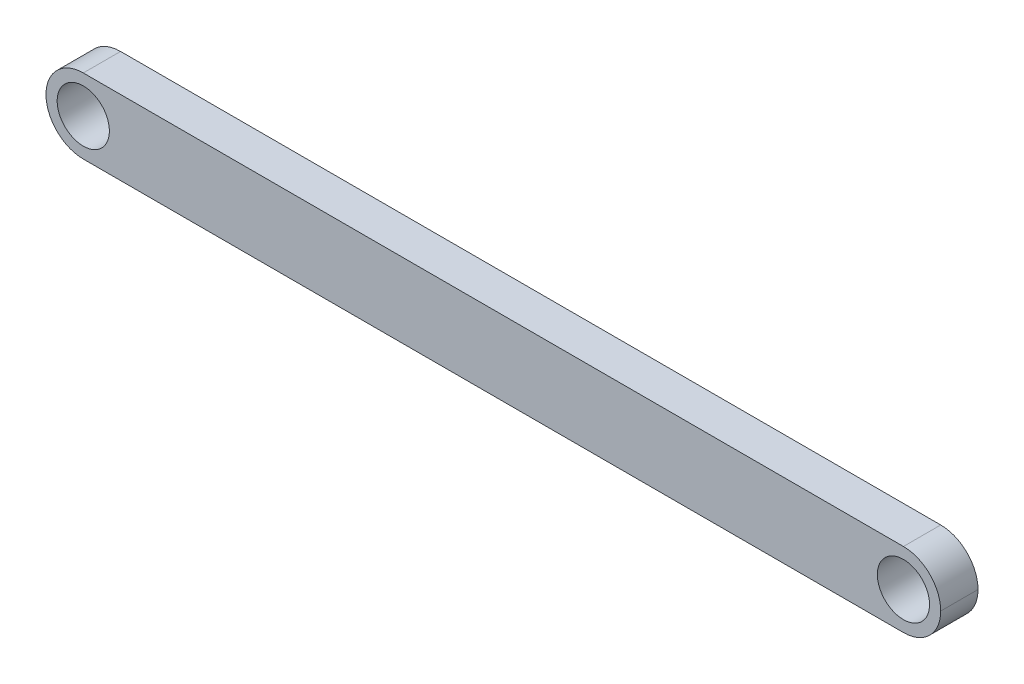
ISO-10303-21;
HEADER;
FILE_DESCRIPTION(('STEP AP214'),'2;1');
FILE_NAME('part.step','',(''),(''),'','','');
FILE_SCHEMA(('AUTOMOTIVE_DESIGN { 1 0 10303 214 1 1 1 1 }'));
ENDSEC;
DATA;
#1=APPLICATION_CONTEXT('core data for automotive mechanical design processes');
#2=APPLICATION_PROTOCOL_DEFINITION('international standard','automotive_design',2000,#1);
#3=PRODUCT_CONTEXT('',#1,'mechanical');
#4=PRODUCT('Part','Part','',(#3));
#5=PRODUCT_RELATED_PRODUCT_CATEGORY('part','',(#4));
#6=PRODUCT_DEFINITION_FORMATION('','',#4);
#7=PRODUCT_DEFINITION_CONTEXT('part definition',#1,'design');
#8=PRODUCT_DEFINITION('design','',#6,#7);
#9=PRODUCT_DEFINITION_SHAPE('','',#8);
#10=(LENGTH_UNIT() NAMED_UNIT(*) SI_UNIT(.MILLI.,.METRE.));
#11=(NAMED_UNIT(*) PLANE_ANGLE_UNIT() SI_UNIT($,.RADIAN.));
#12=(NAMED_UNIT(*) SI_UNIT($,.STERADIAN.) SOLID_ANGLE_UNIT());
#13=UNCERTAINTY_MEASURE_WITH_UNIT(LENGTH_MEASURE(1.E-05),#10,'distance_accuracy_value','');
#14=(GEOMETRIC_REPRESENTATION_CONTEXT(3) GLOBAL_UNCERTAINTY_ASSIGNED_CONTEXT((#13)) GLOBAL_UNIT_ASSIGNED_CONTEXT((#10,
#11,#12)) REPRESENTATION_CONTEXT('',''));
#15=CARTESIAN_POINT('',(0.,0.,0.));
#16=DIRECTION('',(0.,0.,1.));
#17=DIRECTION('',(1.,0.,0.));
#18=AXIS2_PLACEMENT_3D('',#15,#16,#17);
#19=CARTESIAN_POINT('',(0.,0.,10.));
#20=DIRECTION('',(0.,0.,-1.));
#21=DIRECTION('',(-1.,0.,0.));
#22=AXIS2_PLACEMENT_3D('',#19,#20,#21);
#23=PLANE('',#22);
#24=CARTESIAN_POINT('',(110.,0.,10.));
#25=DIRECTION('',(0.,0.,-1.));
#26=DIRECTION('',(-1.,0.,0.));
#27=AXIS2_PLACEMENT_3D('',#24,#25,#26);
#28=CIRCLE('',#27,10.);
#29=CARTESIAN_POINT('',(110.,-10.,10.));
#30=VERTEX_POINT('',#29);
#31=CARTESIAN_POINT('',(120.,0.,10.));
#32=VERTEX_POINT('',#31);
#33=EDGE_CURVE('E136',#30,#32,#28,.F.);
#34=ORIENTED_EDGE('',*,*,#33,.T.);
#35=CARTESIAN_POINT('',(110.,0.,10.));
#36=DIRECTION('',(0.,0.,-1.));
#37=DIRECTION('',(-1.,0.,0.));
#38=AXIS2_PLACEMENT_3D('',#35,#36,#37);
#39=CIRCLE('',#38,10.);
#40=CARTESIAN_POINT('',(110.,10.,10.));
#41=VERTEX_POINT('',#40);
#42=EDGE_CURVE('E138',#32,#41,#39,.F.);
#43=ORIENTED_EDGE('',*,*,#42,.T.);
#44=DIRECTION('',(-1.,0.,0.));
#45=VECTOR('',#44,1.);
#46=CARTESIAN_POINT('',(-120.,10.,10.));
#47=LINE('',#46,#45);
#48=CARTESIAN_POINT('',(-110.,10.,10.));
#49=VERTEX_POINT('',#48);
#50=EDGE_CURVE('E111',#41,#49,#47,.T.);
#51=ORIENTED_EDGE('',*,*,#50,.T.);
#52=CARTESIAN_POINT('',(-110.,0.,10.));
#53=DIRECTION('',(0.,0.,-1.));
#54=DIRECTION('',(-1.,0.,0.));
#55=AXIS2_PLACEMENT_3D('',#52,#53,#54);
#56=CIRCLE('',#55,10.);
#57=CARTESIAN_POINT('',(-120.,0.,10.));
#58=VERTEX_POINT('',#57);
#59=EDGE_CURVE('E101',#49,#58,#56,.F.);
#60=ORIENTED_EDGE('',*,*,#59,.T.);
#61=CARTESIAN_POINT('',(-110.,0.,10.));
#62=DIRECTION('',(0.,0.,-1.));
#63=DIRECTION('',(-1.,0.,0.));
#64=AXIS2_PLACEMENT_3D('',#61,#62,#63);
#65=CIRCLE('',#64,10.);
#66=CARTESIAN_POINT('',(-110.,-10.,10.));
#67=VERTEX_POINT('',#66);
#68=EDGE_CURVE('E59',#58,#67,#65,.F.);
#69=ORIENTED_EDGE('',*,*,#68,.T.);
#70=DIRECTION('',(1.,0.,0.));
#71=VECTOR('',#70,1.);
#72=CARTESIAN_POINT('',(-120.,-10.,10.));
#73=LINE('',#72,#71);
#74=EDGE_CURVE('E126',#67,#30,#73,.T.);
#75=ORIENTED_EDGE('',*,*,#74,.T.);
#76=EDGE_LOOP('',(#34,#43,#51,#60,#69,#75));
#77=FACE_BOUND('',#76,.T.);
#78=CARTESIAN_POINT('',(-110.,0.,10.));
#79=DIRECTION('',(0.,0.,1.));
#80=DIRECTION('',(1.,0.,0.));
#81=AXIS2_PLACEMENT_3D('',#78,#79,#80);
#82=CIRCLE('',#81,7.00000000000002);
#83=CARTESIAN_POINT('',(-103.,0.,10.));
#84=VERTEX_POINT('',#83);
#85=EDGE_CURVE('E119',#84,#84,#82,.T.);
#86=ORIENTED_EDGE('',*,*,#85,.F.);
#87=EDGE_LOOP('',(#86));
#88=FACE_BOUND('',#87,.T.);
#89=CARTESIAN_POINT('',(110.,0.,10.));
#90=DIRECTION('',(0.,0.,1.));
#91=DIRECTION('',(1.,0.,0.));
#92=AXIS2_PLACEMENT_3D('',#89,#90,#91);
#93=CIRCLE('',#92,7.00000000000002);
#94=CARTESIAN_POINT('',(117.,0.,10.));
#95=VERTEX_POINT('',#94);
#96=EDGE_CURVE('E143',#95,#95,#93,.T.);
#97=ORIENTED_EDGE('',*,*,#96,.F.);
#98=EDGE_LOOP('',(#97));
#99=FACE_BOUND('',#98,.T.);
#100=ADVANCED_FACE('F37',(#77,#88,#99),#23,.F.);
#101=CARTESIAN_POINT('',(0.,0.,0.));
#102=DIRECTION('',(0.,0.,-1.));
#103=DIRECTION('',(-1.,0.,0.));
#104=AXIS2_PLACEMENT_3D('',#101,#102,#103);
#105=PLANE('',#104);
#106=CARTESIAN_POINT('',(-110.,0.,0.));
#107=DIRECTION('',(0.,0.,1.));
#108=DIRECTION('',(1.,0.,0.));
#109=AXIS2_PLACEMENT_3D('',#106,#107,#108);
#110=CIRCLE('',#109,7.00000000000002);
#111=CARTESIAN_POINT('',(-103.,0.,0.));
#112=VERTEX_POINT('',#111);
#113=EDGE_CURVE('E123',#112,#112,#110,.T.);
#114=ORIENTED_EDGE('',*,*,#113,.T.);
#115=EDGE_LOOP('',(#114));
#116=FACE_BOUND('',#115,.T.);
#117=DIRECTION('',(-1.,0.,0.));
#118=VECTOR('',#117,1.);
#119=CARTESIAN_POINT('',(-120.,10.,0.));
#120=LINE('',#119,#118);
#121=CARTESIAN_POINT('',(110.,10.,0.));
#122=VERTEX_POINT('',#121);
#123=CARTESIAN_POINT('',(-110.,10.,0.));
#124=VERTEX_POINT('',#123);
#125=EDGE_CURVE('E108',#122,#124,#120,.T.);
#126=ORIENTED_EDGE('',*,*,#125,.F.);
#127=CARTESIAN_POINT('',(110.,0.,0.));
#128=DIRECTION('',(0.,0.,-1.));
#129=DIRECTION('',(-1.,0.,0.));
#130=AXIS2_PLACEMENT_3D('',#127,#128,#129);
#131=CIRCLE('',#130,10.);
#132=CARTESIAN_POINT('',(120.,0.,0.));
#133=VERTEX_POINT('',#132);
#134=EDGE_CURVE('E91',#122,#133,#131,.T.);
#135=ORIENTED_EDGE('',*,*,#134,.T.);
#136=CARTESIAN_POINT('',(110.,0.,0.));
#137=DIRECTION('',(0.,0.,-1.));
#138=DIRECTION('',(-1.,0.,0.));
#139=AXIS2_PLACEMENT_3D('',#136,#137,#138);
#140=CIRCLE('',#139,10.);
#141=CARTESIAN_POINT('',(110.,-10.,0.));
#142=VERTEX_POINT('',#141);
#143=EDGE_CURVE('E102',#133,#142,#140,.T.);
#144=ORIENTED_EDGE('',*,*,#143,.T.);
#145=DIRECTION('',(1.,0.,0.));
#146=VECTOR('',#145,1.);
#147=CARTESIAN_POINT('',(-120.,-10.,0.));
#148=LINE('',#147,#146);
#149=CARTESIAN_POINT('',(-110.,-10.,0.));
#150=VERTEX_POINT('',#149);
#151=EDGE_CURVE('E118',#150,#142,#148,.T.);
#152=ORIENTED_EDGE('',*,*,#151,.F.);
#153=CARTESIAN_POINT('',(-110.,0.,0.));
#154=DIRECTION('',(0.,0.,-1.));
#155=DIRECTION('',(-1.,0.,0.));
#156=AXIS2_PLACEMENT_3D('',#153,#154,#155);
#157=CIRCLE('',#156,10.);
#158=CARTESIAN_POINT('',(-120.,0.,0.));
#159=VERTEX_POINT('',#158);
#160=EDGE_CURVE('E131',#150,#159,#157,.T.);
#161=ORIENTED_EDGE('',*,*,#160,.T.);
#162=CARTESIAN_POINT('',(-110.,0.,0.));
#163=DIRECTION('',(0.,0.,-1.));
#164=DIRECTION('',(-1.,0.,0.));
#165=AXIS2_PLACEMENT_3D('',#162,#163,#164);
#166=CIRCLE('',#165,10.);
#167=EDGE_CURVE('E112',#159,#124,#166,.T.);
#168=ORIENTED_EDGE('',*,*,#167,.T.);
#169=EDGE_LOOP('',(#126,#135,#144,#152,#161,#168));
#170=FACE_BOUND('',#169,.T.);
#171=CARTESIAN_POINT('',(110.,0.,0.));
#172=DIRECTION('',(0.,0.,1.));
#173=DIRECTION('',(1.,0.,0.));
#174=AXIS2_PLACEMENT_3D('',#171,#172,#173);
#175=CIRCLE('',#174,7.00000000000002);
#176=CARTESIAN_POINT('',(117.,0.,0.));
#177=VERTEX_POINT('',#176);
#178=EDGE_CURVE('E141',#177,#177,#175,.T.);
#179=ORIENTED_EDGE('',*,*,#178,.T.);
#180=EDGE_LOOP('',(#179));
#181=FACE_BOUND('',#180,.T.);
#182=ADVANCED_FACE('F115',(#116,#170,#181),#105,.T.);
#183=CARTESIAN_POINT('',(-120.,10.,10.));
#184=DIRECTION('',(0.,-1.,0.));
#185=DIRECTION('',(0.,0.,-1.));
#186=AXIS2_PLACEMENT_3D('',#183,#184,#185);
#187=PLANE('',#186);
#188=ORIENTED_EDGE('',*,*,#50,.F.);
#189=DIRECTION('',(0.,0.,-1.));
#190=VECTOR('',#189,1.);
#191=CARTESIAN_POINT('',(110.,10.,10.));
#192=LINE('',#191,#190);
#193=EDGE_CURVE('E95',#41,#122,#192,.T.);
#194=ORIENTED_EDGE('',*,*,#193,.T.);
#195=ORIENTED_EDGE('',*,*,#125,.T.);
#196=DIRECTION('',(0.,0.,-1.));
#197=VECTOR('',#196,1.);
#198=CARTESIAN_POINT('',(-110.,10.,10.));
#199=LINE('',#198,#197);
#200=EDGE_CURVE('E113',#124,#49,#199,.F.);
#201=ORIENTED_EDGE('',*,*,#200,.T.);
#202=EDGE_LOOP('',(#188,#194,#195,#201));
#203=FACE_BOUND('',#202,.T.);
#204=ADVANCED_FACE('F107',(#203),#187,.F.);
#205=CARTESIAN_POINT('',(-120.,-10.,10.));
#206=DIRECTION('',(0.,1.,0.));
#207=DIRECTION('',(0.,0.,1.));
#208=AXIS2_PLACEMENT_3D('',#205,#206,#207);
#209=PLANE('',#208);
#210=ORIENTED_EDGE('',*,*,#151,.T.);
#211=DIRECTION('',(0.,0.,-1.));
#212=VECTOR('',#211,1.);
#213=CARTESIAN_POINT('',(110.,-10.,10.));
#214=LINE('',#213,#212);
#215=EDGE_CURVE('E11',#142,#30,#214,.F.);
#216=ORIENTED_EDGE('',*,*,#215,.T.);
#217=ORIENTED_EDGE('',*,*,#74,.F.);
#218=DIRECTION('',(0.,0.,-1.));
#219=VECTOR('',#218,1.);
#220=CARTESIAN_POINT('',(-110.,-10.,10.));
#221=LINE('',#220,#219);
#222=EDGE_CURVE('E46',#67,#150,#221,.T.);
#223=ORIENTED_EDGE('',*,*,#222,.T.);
#224=EDGE_LOOP('',(#210,#216,#217,#223));
#225=FACE_BOUND('',#224,.T.);
#226=ADVANCED_FACE('F173',(#225),#209,.F.);
#227=CARTESIAN_POINT('',(-110.,0.,10.));
#228=DIRECTION('',(0.,0.,-1.));
#229=DIRECTION('',(-1.,0.,0.));
#230=AXIS2_PLACEMENT_3D('',#227,#228,#229);
#231=CYLINDRICAL_SURFACE('',#230,7.00000000000002);
#232=ORIENTED_EDGE('',*,*,#85,.T.);
#233=EDGE_LOOP('',(#232));
#234=FACE_BOUND('',#233,.T.);
#235=ORIENTED_EDGE('',*,*,#113,.F.);
#236=EDGE_LOOP('',(#235));
#237=FACE_BOUND('',#236,.T.);
#238=ADVANCED_FACE('F170',(#234,#237),#231,.F.);
#239=CARTESIAN_POINT('',(110.,0.,10.));
#240=DIRECTION('',(0.,0.,-1.));
#241=DIRECTION('',(-1.,0.,0.));
#242=AXIS2_PLACEMENT_3D('',#239,#240,#241);
#243=CYLINDRICAL_SURFACE('',#242,7.00000000000002);
#244=ORIENTED_EDGE('',*,*,#96,.T.);
#245=EDGE_LOOP('',(#244));
#246=FACE_BOUND('',#245,.T.);
#247=ORIENTED_EDGE('',*,*,#178,.F.);
#248=EDGE_LOOP('',(#247));
#249=FACE_BOUND('',#248,.T.);
#250=ADVANCED_FACE('F159',(#246,#249),#243,.F.);
#251=CARTESIAN_POINT('',(110.,0.,10.));
#252=DIRECTION('',(0.,0.,-1.));
#253=DIRECTION('',(-1.,0.,0.));
#254=AXIS2_PLACEMENT_3D('',#251,#252,#253);
#255=CYLINDRICAL_SURFACE('',#254,10.);
#256=DIRECTION('',(0.,0.,-1.));
#257=VECTOR('',#256,1.);
#258=CARTESIAN_POINT('',(120.,0.,10.));
#259=LINE('',#258,#257);
#260=EDGE_CURVE('E97',#32,#133,#259,.T.);
#261=ORIENTED_EDGE('',*,*,#260,.F.);
#262=ORIENTED_EDGE('',*,*,#33,.F.);
#263=ORIENTED_EDGE('',*,*,#215,.F.);
#264=ORIENTED_EDGE('',*,*,#143,.F.);
#265=EDGE_LOOP('',(#261,#262,#263,#264));
#266=FACE_BOUND('',#265,.T.);
#267=ADVANCED_FACE('F180',(#266),#255,.T.);
#268=CARTESIAN_POINT('',(110.,0.,10.));
#269=DIRECTION('',(0.,0.,-1.));
#270=DIRECTION('',(-1.,0.,0.));
#271=AXIS2_PLACEMENT_3D('',#268,#269,#270);
#272=CYLINDRICAL_SURFACE('',#271,10.);
#273=ORIENTED_EDGE('',*,*,#42,.F.);
#274=ORIENTED_EDGE('',*,*,#260,.T.);
#275=ORIENTED_EDGE('',*,*,#134,.F.);
#276=ORIENTED_EDGE('',*,*,#193,.F.);
#277=EDGE_LOOP('',(#273,#274,#275,#276));
#278=FACE_BOUND('',#277,.T.);
#279=ADVANCED_FACE('F94',(#278),#272,.T.);
#280=CARTESIAN_POINT('',(-110.,0.,10.));
#281=DIRECTION('',(0.,0.,-1.));
#282=DIRECTION('',(-1.,0.,0.));
#283=AXIS2_PLACEMENT_3D('',#280,#281,#282);
#284=CYLINDRICAL_SURFACE('',#283,10.);
#285=DIRECTION('',(0.,0.,-1.));
#286=VECTOR('',#285,1.);
#287=CARTESIAN_POINT('',(-120.,0.,10.));
#288=LINE('',#287,#286);
#289=EDGE_CURVE('E41',#58,#159,#288,.T.);
#290=ORIENTED_EDGE('',*,*,#289,.F.);
#291=ORIENTED_EDGE('',*,*,#59,.F.);
#292=ORIENTED_EDGE('',*,*,#200,.F.);
#293=ORIENTED_EDGE('',*,*,#167,.F.);
#294=EDGE_LOOP('',(#290,#291,#292,#293));
#295=FACE_BOUND('',#294,.T.);
#296=ADVANCED_FACE('F39',(#295),#284,.T.);
#297=CARTESIAN_POINT('',(-110.,0.,10.));
#298=DIRECTION('',(0.,0.,-1.));
#299=DIRECTION('',(-1.,0.,0.));
#300=AXIS2_PLACEMENT_3D('',#297,#298,#299);
#301=CYLINDRICAL_SURFACE('',#300,10.);
#302=ORIENTED_EDGE('',*,*,#68,.F.);
#303=ORIENTED_EDGE('',*,*,#289,.T.);
#304=ORIENTED_EDGE('',*,*,#160,.F.);
#305=ORIENTED_EDGE('',*,*,#222,.F.);
#306=EDGE_LOOP('',(#302,#303,#304,#305));
#307=FACE_BOUND('',#306,.T.);
#308=ADVANCED_FACE('F148',(#307),#301,.T.);
#309=CLOSED_SHELL('',(#100,#182,#204,#226,#238,#250,#267,#279,#296,#308));
#310=MANIFOLD_SOLID_BREP('B2',#309);
#311=ADVANCED_BREP_SHAPE_REPRESENTATION('',(#18,#310),#14);
#312=SHAPE_DEFINITION_REPRESENTATION(#9,#311);
ENDSEC;
END-ISO-10303-21;
